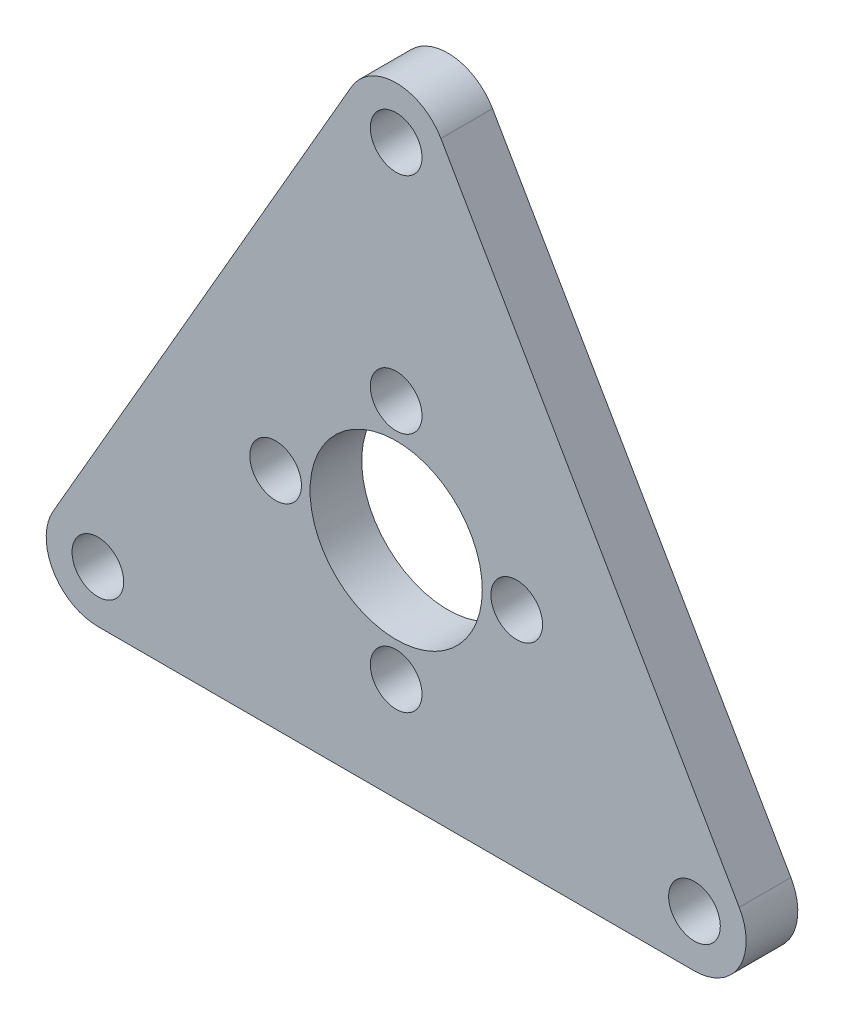
ISO-10303-21;
HEADER;
FILE_DESCRIPTION(('STEP AP214'),'2;1');
FILE_NAME('part.step','',(''),(''),'','','');
FILE_SCHEMA(('AUTOMOTIVE_DESIGN { 1 0 10303 214 1 1 1 1 }'));
ENDSEC;
DATA;
#1=APPLICATION_CONTEXT('core data for automotive mechanical design processes');
#2=APPLICATION_PROTOCOL_DEFINITION('international standard','automotive_design',2000,#1);
#3=PRODUCT_CONTEXT('',#1,'mechanical');
#4=PRODUCT('Part','Part','',(#3));
#5=PRODUCT_RELATED_PRODUCT_CATEGORY('part','',(#4));
#6=PRODUCT_DEFINITION_FORMATION('','',#4);
#7=PRODUCT_DEFINITION_CONTEXT('part definition',#1,'design');
#8=PRODUCT_DEFINITION('design','',#6,#7);
#9=PRODUCT_DEFINITION_SHAPE('','',#8);
#10=(LENGTH_UNIT() NAMED_UNIT(*) SI_UNIT(.MILLI.,.METRE.));
#11=(NAMED_UNIT(*) PLANE_ANGLE_UNIT() SI_UNIT($,.RADIAN.));
#12=(NAMED_UNIT(*) SI_UNIT($,.STERADIAN.) SOLID_ANGLE_UNIT());
#13=UNCERTAINTY_MEASURE_WITH_UNIT(LENGTH_MEASURE(1.E-05),#10,'distance_accuracy_value','');
#14=(GEOMETRIC_REPRESENTATION_CONTEXT(3) GLOBAL_UNCERTAINTY_ASSIGNED_CONTEXT((#13)) GLOBAL_UNIT_ASSIGNED_CONTEXT((#10,
#11,#12)) REPRESENTATION_CONTEXT('',''));
#15=CARTESIAN_POINT('',(0.,0.,0.));
#16=DIRECTION('',(0.,0.,1.));
#17=DIRECTION('',(1.,0.,0.));
#18=AXIS2_PLACEMENT_3D('',#15,#16,#17);
#19=CARTESIAN_POINT('',(-17.3205080756888,-9.99999999999999,3.));
#20=DIRECTION('',(0.,0.,1.));
#21=DIRECTION('',(1.,0.,0.));
#22=AXIS2_PLACEMENT_3D('',#19,#20,#21);
#23=PLANE('',#22);
#24=CARTESIAN_POINT('',(-7.,0.,3.));
#25=DIRECTION('',(0.,0.,1.));
#26=DIRECTION('',(1.,0.,0.));
#27=AXIS2_PLACEMENT_3D('',#24,#25,#26);
#28=CIRCLE('',#27,1.5);
#29=CARTESIAN_POINT('',(-5.5,0.,3.));
#30=VERTEX_POINT('',#29);
#31=EDGE_CURVE('E206',#30,#30,#28,.T.);
#32=ORIENTED_EDGE('',*,*,#31,.F.);
#33=EDGE_LOOP('',(#32));
#34=FACE_BOUND('',#33,.T.);
#35=CARTESIAN_POINT('',(0.,7.,3.));
#36=DIRECTION('',(0.,0.,1.));
#37=DIRECTION('',(1.,0.,0.));
#38=AXIS2_PLACEMENT_3D('',#35,#36,#37);
#39=CIRCLE('',#38,1.5);
#40=CARTESIAN_POINT('',(1.5,7.,3.));
#41=VERTEX_POINT('',#40);
#42=EDGE_CURVE('E218',#41,#41,#39,.T.);
#43=ORIENTED_EDGE('',*,*,#42,.F.);
#44=EDGE_LOOP('',(#43));
#45=FACE_BOUND('',#44,.T.);
#46=CARTESIAN_POINT('',(17.3205080756888,-10.,3.));
#47=DIRECTION('',(0.,0.,1.));
#48=DIRECTION('',(1.,0.,0.));
#49=AXIS2_PLACEMENT_3D('',#46,#47,#48);
#50=CIRCLE('',#49,1.5);
#51=CARTESIAN_POINT('',(18.8205080756888,-10.,3.));
#52=VERTEX_POINT('',#51);
#53=EDGE_CURVE('E230',#52,#52,#50,.T.);
#54=ORIENTED_EDGE('',*,*,#53,.F.);
#55=EDGE_LOOP('',(#54));
#56=FACE_BOUND('',#55,.T.);
#57=CARTESIAN_POINT('',(-17.3205080756888,-10.,3.));
#58=DIRECTION('',(0.,0.,1.));
#59=DIRECTION('',(1.,0.,0.));
#60=AXIS2_PLACEMENT_3D('',#57,#58,#59);
#61=CIRCLE('',#60,1.5);
#62=CARTESIAN_POINT('',(-15.8205080756888,-10.,3.));
#63=VERTEX_POINT('',#62);
#64=EDGE_CURVE('E123',#63,#63,#61,.T.);
#65=ORIENTED_EDGE('',*,*,#64,.F.);
#66=EDGE_LOOP('',(#65));
#67=FACE_BOUND('',#66,.T.);
#68=CARTESIAN_POINT('',(-17.3205080756888,-9.99999999999999,3.));
#69=DIRECTION('',(0.,0.,1.));
#70=DIRECTION('',(1.,0.,0.));
#71=AXIS2_PLACEMENT_3D('',#68,#69,#70);
#72=CIRCLE('',#71,3.);
#73=CARTESIAN_POINT('',(-19.9185842870421,-8.49999999999999,3.));
#74=VERTEX_POINT('',#73);
#75=CARTESIAN_POINT('',(-17.3205080756888,-13.,3.));
#76=VERTEX_POINT('',#75);
#77=EDGE_CURVE('E130',#74,#76,#72,.T.);
#78=ORIENTED_EDGE('',*,*,#77,.T.);
#79=DIRECTION('',(1.,0.,0.));
#80=VECTOR('',#79,1.);
#81=CARTESIAN_POINT('',(-17.3205080756888,-13.,3.));
#82=LINE('',#81,#80);
#83=CARTESIAN_POINT('',(17.3205080756888,-13.,3.));
#84=VERTEX_POINT('',#83);
#85=EDGE_CURVE('E88',#76,#84,#82,.T.);
#86=ORIENTED_EDGE('',*,*,#85,.T.);
#87=CARTESIAN_POINT('',(17.3205080756888,-9.99999999999999,3.));
#88=DIRECTION('',(0.,0.,1.));
#89=DIRECTION('',(1.,0.,0.));
#90=AXIS2_PLACEMENT_3D('',#87,#88,#89);
#91=CIRCLE('',#90,3.);
#92=CARTESIAN_POINT('',(19.9185842870421,-8.49999999999999,3.));
#93=VERTEX_POINT('',#92);
#94=EDGE_CURVE('E101',#84,#93,#91,.T.);
#95=ORIENTED_EDGE('',*,*,#94,.T.);
#96=DIRECTION('',(-0.5,0.866025403784439,0.));
#97=VECTOR('',#96,1.);
#98=CARTESIAN_POINT('',(19.9185842870421,-8.49999999999999,3.));
#99=LINE('',#98,#97);
#100=CARTESIAN_POINT('',(2.59807621135331,21.5,3.));
#101=VERTEX_POINT('',#100);
#102=EDGE_CURVE('E95',#93,#101,#99,.T.);
#103=ORIENTED_EDGE('',*,*,#102,.T.);
#104=CARTESIAN_POINT('',(0.,20.,3.));
#105=DIRECTION('',(0.,0.,1.));
#106=DIRECTION('',(-1.,0.,0.));
#107=AXIS2_PLACEMENT_3D('',#104,#105,#106);
#108=CIRCLE('',#107,3.);
#109=CARTESIAN_POINT('',(-2.59807621135331,21.5,3.));
#110=VERTEX_POINT('',#109);
#111=EDGE_CURVE('E99',#101,#110,#108,.T.);
#112=ORIENTED_EDGE('',*,*,#111,.T.);
#113=DIRECTION('',(-0.5,-0.866025403784439,0.));
#114=VECTOR('',#113,1.);
#115=CARTESIAN_POINT('',(-2.59807621135331,21.5,3.));
#116=LINE('',#115,#114);
#117=EDGE_CURVE('E51',#110,#74,#116,.T.);
#118=ORIENTED_EDGE('',*,*,#117,.T.);
#119=EDGE_LOOP('',(#78,#86,#95,#103,#112,#118));
#120=FACE_BOUND('',#119,.T.);
#121=CARTESIAN_POINT('',(0.,20.,3.));
#122=DIRECTION('',(0.,0.,1.));
#123=DIRECTION('',(1.,0.,0.));
#124=AXIS2_PLACEMENT_3D('',#121,#122,#123);
#125=CIRCLE('',#124,1.5);
#126=CARTESIAN_POINT('',(1.5,20.,3.));
#127=VERTEX_POINT('',#126);
#128=EDGE_CURVE('E236',#127,#127,#125,.T.);
#129=ORIENTED_EDGE('',*,*,#128,.F.);
#130=EDGE_LOOP('',(#129));
#131=FACE_BOUND('',#130,.T.);
#132=CARTESIAN_POINT('',(0.,0.,3.));
#133=DIRECTION('',(0.,0.,1.));
#134=DIRECTION('',(1.,0.,0.));
#135=AXIS2_PLACEMENT_3D('',#132,#133,#134);
#136=CIRCLE('',#135,5.);
#137=CARTESIAN_POINT('',(5.,0.,3.));
#138=VERTEX_POINT('',#137);
#139=EDGE_CURVE('E224',#138,#138,#136,.T.);
#140=ORIENTED_EDGE('',*,*,#139,.F.);
#141=EDGE_LOOP('',(#140));
#142=FACE_BOUND('',#141,.T.);
#143=CARTESIAN_POINT('',(0.,-7.,3.));
#144=DIRECTION('',(0.,0.,1.));
#145=DIRECTION('',(1.,0.,0.));
#146=AXIS2_PLACEMENT_3D('',#143,#144,#145);
#147=CIRCLE('',#146,1.5);
#148=CARTESIAN_POINT('',(1.5,-7.,3.));
#149=VERTEX_POINT('',#148);
#150=EDGE_CURVE('E212',#149,#149,#147,.T.);
#151=ORIENTED_EDGE('',*,*,#150,.F.);
#152=EDGE_LOOP('',(#151));
#153=FACE_BOUND('',#152,.T.);
#154=CARTESIAN_POINT('',(7.,0.,3.));
#155=DIRECTION('',(0.,0.,1.));
#156=DIRECTION('',(1.,0.,0.));
#157=AXIS2_PLACEMENT_3D('',#154,#155,#156);
#158=CIRCLE('',#157,1.5);
#159=CARTESIAN_POINT('',(8.5,0.,3.));
#160=VERTEX_POINT('',#159);
#161=EDGE_CURVE('E197',#160,#160,#158,.T.);
#162=ORIENTED_EDGE('',*,*,#161,.F.);
#163=EDGE_LOOP('',(#162));
#164=FACE_BOUND('',#163,.T.);
#165=ADVANCED_FACE('F34',(#34,#45,#56,#67,#120,#131,#142,#153,#164),#23,.T.);
#166=CARTESIAN_POINT('',(-17.3205080756888,-9.99999999999999,0.));
#167=DIRECTION('',(0.,0.,1.));
#168=DIRECTION('',(1.,0.,0.));
#169=AXIS2_PLACEMENT_3D('',#166,#167,#168);
#170=PLANE('',#169);
#171=CARTESIAN_POINT('',(-17.3205080756888,-9.99999999999999,0.));
#172=DIRECTION('',(0.,0.,1.));
#173=DIRECTION('',(1.,0.,0.));
#174=AXIS2_PLACEMENT_3D('',#171,#172,#173);
#175=CIRCLE('',#174,3.);
#176=CARTESIAN_POINT('',(-19.9185842870421,-8.49999999999999,0.));
#177=VERTEX_POINT('',#176);
#178=CARTESIAN_POINT('',(-17.3205080756888,-13.,0.));
#179=VERTEX_POINT('',#178);
#180=EDGE_CURVE('E119',#177,#179,#175,.T.);
#181=ORIENTED_EDGE('',*,*,#180,.F.);
#182=DIRECTION('',(-0.5,-0.866025403784439,0.));
#183=VECTOR('',#182,1.);
#184=CARTESIAN_POINT('',(-2.59807621135331,21.5,0.));
#185=LINE('',#184,#183);
#186=CARTESIAN_POINT('',(-2.59807621135331,21.5,0.));
#187=VERTEX_POINT('',#186);
#188=EDGE_CURVE('E80',#187,#177,#185,.T.);
#189=ORIENTED_EDGE('',*,*,#188,.F.);
#190=CARTESIAN_POINT('',(0.,20.,0.));
#191=DIRECTION('',(0.,0.,1.));
#192=DIRECTION('',(-1.,0.,0.));
#193=AXIS2_PLACEMENT_3D('',#190,#191,#192);
#194=CIRCLE('',#193,3.);
#195=CARTESIAN_POINT('',(2.59807621135331,21.5,0.));
#196=VERTEX_POINT('',#195);
#197=EDGE_CURVE('E74',#196,#187,#194,.T.);
#198=ORIENTED_EDGE('',*,*,#197,.F.);
#199=DIRECTION('',(-0.5,0.866025403784439,0.));
#200=VECTOR('',#199,1.);
#201=CARTESIAN_POINT('',(19.9185842870421,-8.49999999999999,0.));
#202=LINE('',#201,#200);
#203=CARTESIAN_POINT('',(19.9185842870421,-8.49999999999999,0.));
#204=VERTEX_POINT('',#203);
#205=EDGE_CURVE('E109',#204,#196,#202,.T.);
#206=ORIENTED_EDGE('',*,*,#205,.F.);
#207=CARTESIAN_POINT('',(17.3205080756888,-9.99999999999999,0.));
#208=DIRECTION('',(0.,0.,1.));
#209=DIRECTION('',(1.,0.,0.));
#210=AXIS2_PLACEMENT_3D('',#207,#208,#209);
#211=CIRCLE('',#210,3.);
#212=CARTESIAN_POINT('',(17.3205080756888,-13.,0.));
#213=VERTEX_POINT('',#212);
#214=EDGE_CURVE('E125',#213,#204,#211,.T.);
#215=ORIENTED_EDGE('',*,*,#214,.F.);
#216=DIRECTION('',(1.,0.,0.));
#217=VECTOR('',#216,1.);
#218=CARTESIAN_POINT('',(-17.3205080756888,-13.,0.));
#219=LINE('',#218,#217);
#220=EDGE_CURVE('E122',#179,#213,#219,.T.);
#221=ORIENTED_EDGE('',*,*,#220,.F.);
#222=EDGE_LOOP('',(#181,#189,#198,#206,#215,#221));
#223=FACE_BOUND('',#222,.T.);
#224=CARTESIAN_POINT('',(-17.3205080756888,-10.,0.));
#225=DIRECTION('',(0.,0.,1.));
#226=DIRECTION('',(1.,0.,0.));
#227=AXIS2_PLACEMENT_3D('',#224,#225,#226);
#228=CIRCLE('',#227,1.5);
#229=CARTESIAN_POINT('',(-15.8205080756888,-10.,0.));
#230=VERTEX_POINT('',#229);
#231=EDGE_CURVE('E239',#230,#230,#228,.T.);
#232=ORIENTED_EDGE('',*,*,#231,.T.);
#233=EDGE_LOOP('',(#232));
#234=FACE_BOUND('',#233,.T.);
#235=CARTESIAN_POINT('',(0.,20.,0.));
#236=DIRECTION('',(0.,0.,1.));
#237=DIRECTION('',(1.,0.,0.));
#238=AXIS2_PLACEMENT_3D('',#235,#236,#237);
#239=CIRCLE('',#238,1.5);
#240=CARTESIAN_POINT('',(1.5,20.,0.));
#241=VERTEX_POINT('',#240);
#242=EDGE_CURVE('E233',#241,#241,#239,.T.);
#243=ORIENTED_EDGE('',*,*,#242,.T.);
#244=EDGE_LOOP('',(#243));
#245=FACE_BOUND('',#244,.T.);
#246=CARTESIAN_POINT('',(17.3205080756888,-10.,0.));
#247=DIRECTION('',(0.,0.,1.));
#248=DIRECTION('',(1.,0.,0.));
#249=AXIS2_PLACEMENT_3D('',#246,#247,#248);
#250=CIRCLE('',#249,1.5);
#251=CARTESIAN_POINT('',(18.8205080756888,-10.,0.));
#252=VERTEX_POINT('',#251);
#253=EDGE_CURVE('E227',#252,#252,#250,.T.);
#254=ORIENTED_EDGE('',*,*,#253,.T.);
#255=EDGE_LOOP('',(#254));
#256=FACE_BOUND('',#255,.T.);
#257=CARTESIAN_POINT('',(0.,0.,0.));
#258=DIRECTION('',(0.,0.,1.));
#259=DIRECTION('',(1.,0.,0.));
#260=AXIS2_PLACEMENT_3D('',#257,#258,#259);
#261=CIRCLE('',#260,5.);
#262=CARTESIAN_POINT('',(5.,0.,0.));
#263=VERTEX_POINT('',#262);
#264=EDGE_CURVE('E221',#263,#263,#261,.T.);
#265=ORIENTED_EDGE('',*,*,#264,.T.);
#266=EDGE_LOOP('',(#265));
#267=FACE_BOUND('',#266,.T.);
#268=CARTESIAN_POINT('',(0.,7.,0.));
#269=DIRECTION('',(0.,0.,1.));
#270=DIRECTION('',(1.,0.,0.));
#271=AXIS2_PLACEMENT_3D('',#268,#269,#270);
#272=CIRCLE('',#271,1.5);
#273=CARTESIAN_POINT('',(1.5,7.,0.));
#274=VERTEX_POINT('',#273);
#275=EDGE_CURVE('E215',#274,#274,#272,.T.);
#276=ORIENTED_EDGE('',*,*,#275,.T.);
#277=EDGE_LOOP('',(#276));
#278=FACE_BOUND('',#277,.T.);
#279=CARTESIAN_POINT('',(0.,-7.,0.));
#280=DIRECTION('',(0.,0.,1.));
#281=DIRECTION('',(1.,0.,0.));
#282=AXIS2_PLACEMENT_3D('',#279,#280,#281);
#283=CIRCLE('',#282,1.5);
#284=CARTESIAN_POINT('',(1.5,-7.,0.));
#285=VERTEX_POINT('',#284);
#286=EDGE_CURVE('E209',#285,#285,#283,.T.);
#287=ORIENTED_EDGE('',*,*,#286,.T.);
#288=EDGE_LOOP('',(#287));
#289=FACE_BOUND('',#288,.T.);
#290=CARTESIAN_POINT('',(-7.,0.,0.));
#291=DIRECTION('',(0.,0.,1.));
#292=DIRECTION('',(1.,0.,0.));
#293=AXIS2_PLACEMENT_3D('',#290,#291,#292);
#294=CIRCLE('',#293,1.5);
#295=CARTESIAN_POINT('',(-5.5,0.,0.));
#296=VERTEX_POINT('',#295);
#297=EDGE_CURVE('E203',#296,#296,#294,.T.);
#298=ORIENTED_EDGE('',*,*,#297,.T.);
#299=EDGE_LOOP('',(#298));
#300=FACE_BOUND('',#299,.T.);
#301=CARTESIAN_POINT('',(7.,0.,0.));
#302=DIRECTION('',(0.,0.,1.));
#303=DIRECTION('',(1.,0.,0.));
#304=AXIS2_PLACEMENT_3D('',#301,#302,#303);
#305=CIRCLE('',#304,1.5);
#306=CARTESIAN_POINT('',(8.5,0.,0.));
#307=VERTEX_POINT('',#306);
#308=EDGE_CURVE('E200',#307,#307,#305,.T.);
#309=ORIENTED_EDGE('',*,*,#308,.T.);
#310=EDGE_LOOP('',(#309));
#311=FACE_BOUND('',#310,.T.);
#312=ADVANCED_FACE('F139',(#223,#234,#245,#256,#267,#278,#289,#300,#311),#170,.F.);
#313=CARTESIAN_POINT('',(-17.3205080756888,-9.99999999999999,3.));
#314=DIRECTION('',(0.,0.,-1.));
#315=DIRECTION('',(-1.,0.,0.));
#316=AXIS2_PLACEMENT_3D('',#313,#314,#315);
#317=CYLINDRICAL_SURFACE('',#316,3.);
#318=ORIENTED_EDGE('',*,*,#180,.T.);
#319=DIRECTION('',(0.,0.,-1.));
#320=VECTOR('',#319,1.);
#321=CARTESIAN_POINT('',(-17.3205080756888,-13.,3.));
#322=LINE('',#321,#320);
#323=EDGE_CURVE('E11',#76,#179,#322,.T.);
#324=ORIENTED_EDGE('',*,*,#323,.F.);
#325=ORIENTED_EDGE('',*,*,#77,.F.);
#326=DIRECTION('',(0.,0.,-1.));
#327=VECTOR('',#326,1.);
#328=CARTESIAN_POINT('',(-19.9185842870421,-8.49999999999999,3.));
#329=LINE('',#328,#327);
#330=EDGE_CURVE('E115',#74,#177,#329,.T.);
#331=ORIENTED_EDGE('',*,*,#330,.T.);
#332=EDGE_LOOP('',(#318,#324,#325,#331));
#333=FACE_BOUND('',#332,.T.);
#334=ADVANCED_FACE('F36',(#333),#317,.T.);
#335=CARTESIAN_POINT('',(-17.3205080756888,-13.,3.));
#336=DIRECTION('',(0.,1.,0.));
#337=DIRECTION('',(0.,0.,1.));
#338=AXIS2_PLACEMENT_3D('',#335,#336,#337);
#339=PLANE('',#338);
#340=ORIENTED_EDGE('',*,*,#220,.T.);
#341=DIRECTION('',(0.,0.,-1.));
#342=VECTOR('',#341,1.);
#343=CARTESIAN_POINT('',(17.3205080756888,-13.,3.));
#344=LINE('',#343,#342);
#345=EDGE_CURVE('E43',#84,#213,#344,.T.);
#346=ORIENTED_EDGE('',*,*,#345,.F.);
#347=ORIENTED_EDGE('',*,*,#85,.F.);
#348=ORIENTED_EDGE('',*,*,#323,.T.);
#349=EDGE_LOOP('',(#340,#346,#347,#348));
#350=FACE_BOUND('',#349,.T.);
#351=ADVANCED_FACE('F333',(#350),#339,.F.);
#352=CARTESIAN_POINT('',(17.3205080756888,-9.99999999999999,3.));
#353=DIRECTION('',(0.,0.,-1.));
#354=DIRECTION('',(-1.,0.,0.));
#355=AXIS2_PLACEMENT_3D('',#352,#353,#354);
#356=CYLINDRICAL_SURFACE('',#355,3.);
#357=ORIENTED_EDGE('',*,*,#214,.T.);
#358=DIRECTION('',(0.,0.,-1.));
#359=VECTOR('',#358,1.);
#360=CARTESIAN_POINT('',(19.9185842870421,-8.49999999999999,3.));
#361=LINE('',#360,#359);
#362=EDGE_CURVE('E110',#93,#204,#361,.T.);
#363=ORIENTED_EDGE('',*,*,#362,.F.);
#364=ORIENTED_EDGE('',*,*,#94,.F.);
#365=ORIENTED_EDGE('',*,*,#345,.T.);
#366=EDGE_LOOP('',(#357,#363,#364,#365));
#367=FACE_BOUND('',#366,.T.);
#368=ADVANCED_FACE('F136',(#367),#356,.T.);
#369=CARTESIAN_POINT('',(19.9185842870421,-8.49999999999999,3.));
#370=DIRECTION('',(-0.866025403784439,-0.5,0.));
#371=DIRECTION('',(0.5,-0.866025403784439,0.));
#372=AXIS2_PLACEMENT_3D('',#369,#370,#371);
#373=PLANE('',#372);
#374=ORIENTED_EDGE('',*,*,#205,.T.);
#375=DIRECTION('',(0.,0.,-1.));
#376=VECTOR('',#375,1.);
#377=CARTESIAN_POINT('',(2.59807621135331,21.5,3.));
#378=LINE('',#377,#376);
#379=EDGE_CURVE('E106',#101,#196,#378,.T.);
#380=ORIENTED_EDGE('',*,*,#379,.F.);
#381=ORIENTED_EDGE('',*,*,#102,.F.);
#382=ORIENTED_EDGE('',*,*,#362,.T.);
#383=EDGE_LOOP('',(#374,#380,#381,#382));
#384=FACE_BOUND('',#383,.T.);
#385=ADVANCED_FACE('F107',(#384),#373,.F.);
#386=CARTESIAN_POINT('',(0.,20.,3.));
#387=DIRECTION('',(0.,0.,-1.));
#388=DIRECTION('',(-1.,0.,0.));
#389=AXIS2_PLACEMENT_3D('',#386,#387,#388);
#390=CYLINDRICAL_SURFACE('',#389,3.);
#391=ORIENTED_EDGE('',*,*,#197,.T.);
#392=DIRECTION('',(0.,0.,-1.));
#393=VECTOR('',#392,1.);
#394=CARTESIAN_POINT('',(-2.59807621135331,21.5,3.));
#395=LINE('',#394,#393);
#396=EDGE_CURVE('E111',#110,#187,#395,.T.);
#397=ORIENTED_EDGE('',*,*,#396,.F.);
#398=ORIENTED_EDGE('',*,*,#111,.F.);
#399=ORIENTED_EDGE('',*,*,#379,.T.);
#400=EDGE_LOOP('',(#391,#397,#398,#399));
#401=FACE_BOUND('',#400,.T.);
#402=ADVANCED_FACE('F113',(#401),#390,.T.);
#403=CARTESIAN_POINT('',(-2.59807621135331,21.5,3.));
#404=DIRECTION('',(0.866025403784438,-0.5,0.));
#405=DIRECTION('',(0.5,0.866025403784439,0.));
#406=AXIS2_PLACEMENT_3D('',#403,#404,#405);
#407=PLANE('',#406);
#408=ORIENTED_EDGE('',*,*,#188,.T.);
#409=ORIENTED_EDGE('',*,*,#330,.F.);
#410=ORIENTED_EDGE('',*,*,#117,.F.);
#411=ORIENTED_EDGE('',*,*,#396,.T.);
#412=EDGE_LOOP('',(#408,#409,#410,#411));
#413=FACE_BOUND('',#412,.T.);
#414=ADVANCED_FACE('F144',(#413),#407,.F.);
#415=CARTESIAN_POINT('',(-17.3205080756888,-10.,3.));
#416=DIRECTION('',(0.,0.,-1.));
#417=DIRECTION('',(-1.,0.,0.));
#418=AXIS2_PLACEMENT_3D('',#415,#416,#417);
#419=CYLINDRICAL_SURFACE('',#418,1.5);
#420=ORIENTED_EDGE('',*,*,#64,.T.);
#421=EDGE_LOOP('',(#420));
#422=FACE_BOUND('',#421,.T.);
#423=ORIENTED_EDGE('',*,*,#231,.F.);
#424=EDGE_LOOP('',(#423));
#425=FACE_BOUND('',#424,.T.);
#426=ADVANCED_FACE('F146',(#422,#425),#419,.F.);
#427=CARTESIAN_POINT('',(0.,20.,3.));
#428=DIRECTION('',(0.,0.,-1.));
#429=DIRECTION('',(-1.,0.,0.));
#430=AXIS2_PLACEMENT_3D('',#427,#428,#429);
#431=CYLINDRICAL_SURFACE('',#430,1.5);
#432=ORIENTED_EDGE('',*,*,#128,.T.);
#433=EDGE_LOOP('',(#432));
#434=FACE_BOUND('',#433,.T.);
#435=ORIENTED_EDGE('',*,*,#242,.F.);
#436=EDGE_LOOP('',(#435));
#437=FACE_BOUND('',#436,.T.);
#438=ADVANCED_FACE('F152',(#434,#437),#431,.F.);
#439=CARTESIAN_POINT('',(17.3205080756888,-10.,3.));
#440=DIRECTION('',(0.,0.,-1.));
#441=DIRECTION('',(-1.,0.,0.));
#442=AXIS2_PLACEMENT_3D('',#439,#440,#441);
#443=CYLINDRICAL_SURFACE('',#442,1.5);
#444=ORIENTED_EDGE('',*,*,#53,.T.);
#445=EDGE_LOOP('',(#444));
#446=FACE_BOUND('',#445,.T.);
#447=ORIENTED_EDGE('',*,*,#253,.F.);
#448=EDGE_LOOP('',(#447));
#449=FACE_BOUND('',#448,.T.);
#450=ADVANCED_FACE('F168',(#446,#449),#443,.F.);
#451=CARTESIAN_POINT('',(0.,0.,3.));
#452=DIRECTION('',(0.,0.,-1.));
#453=DIRECTION('',(-1.,0.,0.));
#454=AXIS2_PLACEMENT_3D('',#451,#452,#453);
#455=CYLINDRICAL_SURFACE('',#454,5.);
#456=ORIENTED_EDGE('',*,*,#139,.T.);
#457=EDGE_LOOP('',(#456));
#458=FACE_BOUND('',#457,.T.);
#459=ORIENTED_EDGE('',*,*,#264,.F.);
#460=EDGE_LOOP('',(#459));
#461=FACE_BOUND('',#460,.T.);
#462=ADVANCED_FACE('F172',(#458,#461),#455,.F.);
#463=CARTESIAN_POINT('',(0.,7.,3.));
#464=DIRECTION('',(0.,0.,-1.));
#465=DIRECTION('',(-1.,0.,0.));
#466=AXIS2_PLACEMENT_3D('',#463,#464,#465);
#467=CYLINDRICAL_SURFACE('',#466,1.5);
#468=ORIENTED_EDGE('',*,*,#42,.T.);
#469=EDGE_LOOP('',(#468));
#470=FACE_BOUND('',#469,.T.);
#471=ORIENTED_EDGE('',*,*,#275,.F.);
#472=EDGE_LOOP('',(#471));
#473=FACE_BOUND('',#472,.T.);
#474=ADVANCED_FACE('F176',(#470,#473),#467,.F.);
#475=CARTESIAN_POINT('',(0.,-7.,3.));
#476=DIRECTION('',(0.,0.,-1.));
#477=DIRECTION('',(-1.,0.,0.));
#478=AXIS2_PLACEMENT_3D('',#475,#476,#477);
#479=CYLINDRICAL_SURFACE('',#478,1.5);
#480=ORIENTED_EDGE('',*,*,#150,.T.);
#481=EDGE_LOOP('',(#480));
#482=FACE_BOUND('',#481,.T.);
#483=ORIENTED_EDGE('',*,*,#286,.F.);
#484=EDGE_LOOP('',(#483));
#485=FACE_BOUND('',#484,.T.);
#486=ADVANCED_FACE('F180',(#482,#485),#479,.F.);
#487=CARTESIAN_POINT('',(-7.,0.,3.));
#488=DIRECTION('',(0.,0.,-1.));
#489=DIRECTION('',(-1.,0.,0.));
#490=AXIS2_PLACEMENT_3D('',#487,#488,#489);
#491=CYLINDRICAL_SURFACE('',#490,1.5);
#492=ORIENTED_EDGE('',*,*,#31,.T.);
#493=EDGE_LOOP('',(#492));
#494=FACE_BOUND('',#493,.T.);
#495=ORIENTED_EDGE('',*,*,#297,.F.);
#496=EDGE_LOOP('',(#495));
#497=FACE_BOUND('',#496,.T.);
#498=ADVANCED_FACE('F184',(#494,#497),#491,.F.);
#499=CARTESIAN_POINT('',(7.,0.,3.));
#500=DIRECTION('',(0.,0.,-1.));
#501=DIRECTION('',(-1.,0.,0.));
#502=AXIS2_PLACEMENT_3D('',#499,#500,#501);
#503=CYLINDRICAL_SURFACE('',#502,1.5);
#504=ORIENTED_EDGE('',*,*,#161,.T.);
#505=EDGE_LOOP('',(#504));
#506=FACE_BOUND('',#505,.T.);
#507=ORIENTED_EDGE('',*,*,#308,.F.);
#508=EDGE_LOOP('',(#507));
#509=FACE_BOUND('',#508,.T.);
#510=ADVANCED_FACE('F188',(#506,#509),#503,.F.);
#511=CLOSED_SHELL('',(#165,#312,#334,#351,#368,#385,#402,#414,#426,#438,#450,#462,#474,#486,
#498,#510));
#512=MANIFOLD_SOLID_BREP('B2',#511);
#513=ADVANCED_BREP_SHAPE_REPRESENTATION('',(#18,#512),#14);
#514=SHAPE_DEFINITION_REPRESENTATION(#9,#513);
ENDSEC;
END-ISO-10303-21;
